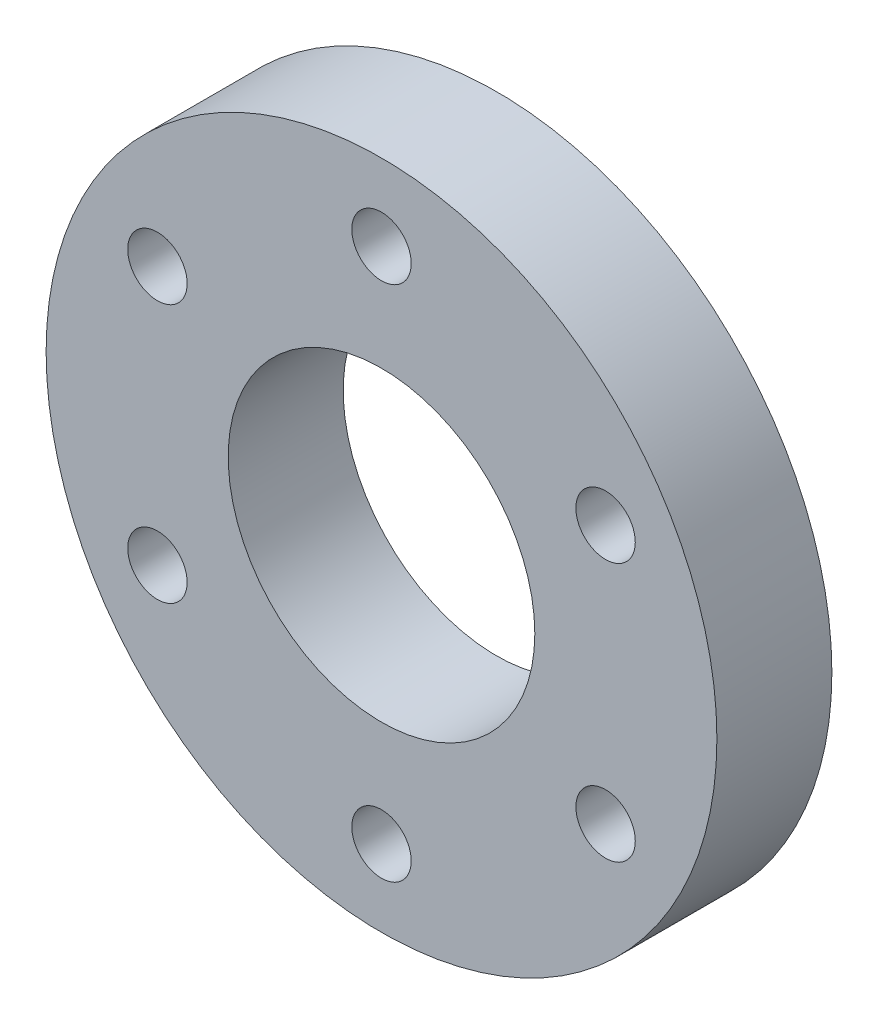
ISO-10303-21;
HEADER;
FILE_DESCRIPTION(('STEP AP214'),'2;1');
FILE_NAME('part.step','',(''),(''),'','','');
FILE_SCHEMA(('AUTOMOTIVE_DESIGN { 1 0 10303 214 1 1 1 1 }'));
ENDSEC;
DATA;
#1=APPLICATION_CONTEXT('core data for automotive mechanical design processes');
#2=APPLICATION_PROTOCOL_DEFINITION('international standard','automotive_design',2000,#1);
#3=PRODUCT_CONTEXT('',#1,'mechanical');
#4=PRODUCT('Part','Part','',(#3));
#5=PRODUCT_RELATED_PRODUCT_CATEGORY('part','',(#4));
#6=PRODUCT_DEFINITION_FORMATION('','',#4);
#7=PRODUCT_DEFINITION_CONTEXT('part definition',#1,'design');
#8=PRODUCT_DEFINITION('design','',#6,#7);
#9=PRODUCT_DEFINITION_SHAPE('','',#8);
#10=(LENGTH_UNIT() NAMED_UNIT(*) SI_UNIT(.MILLI.,.METRE.));
#11=(NAMED_UNIT(*) PLANE_ANGLE_UNIT() SI_UNIT($,.RADIAN.));
#12=(NAMED_UNIT(*) SI_UNIT($,.STERADIAN.) SOLID_ANGLE_UNIT());
#13=UNCERTAINTY_MEASURE_WITH_UNIT(LENGTH_MEASURE(1.E-05),#10,'distance_accuracy_value','');
#14=(GEOMETRIC_REPRESENTATION_CONTEXT(3) GLOBAL_UNCERTAINTY_ASSIGNED_CONTEXT((#13)) GLOBAL_UNIT_ASSIGNED_CONTEXT((#10,
#11,#12)) REPRESENTATION_CONTEXT('',''));
#15=CARTESIAN_POINT('',(0.,0.,0.));
#16=DIRECTION('',(0.,0.,1.));
#17=DIRECTION('',(1.,0.,0.));
#18=AXIS2_PLACEMENT_3D('',#15,#16,#17);
#19=CARTESIAN_POINT('',(0.,0.,6.));
#20=DIRECTION('',(0.,0.,1.));
#21=DIRECTION('',(1.,0.,0.));
#22=AXIS2_PLACEMENT_3D('',#19,#20,#21);
#23=PLANE('',#22);
#24=CARTESIAN_POINT('',(11.6913429510899,6.75000000000006,6.));
#25=DIRECTION('',(0.,0.,1.));
#26=DIRECTION('',(1.,0.,0.));
#27=AXIS2_PLACEMENT_3D('',#24,#25,#26);
#28=CIRCLE('',#27,1.55);
#29=CARTESIAN_POINT('',(13.2413429510899,6.75000000000006,6.));
#30=VERTEX_POINT('',#29);
#31=EDGE_CURVE('E92',#30,#30,#28,.T.);
#32=ORIENTED_EDGE('',*,*,#31,.F.);
#33=EDGE_LOOP('',(#32));
#34=FACE_BOUND('',#33,.T.);
#35=CARTESIAN_POINT('',(-11.6913429510899,6.74999999999997,6.));
#36=DIRECTION('',(0.,0.,1.));
#37=DIRECTION('',(1.,0.,0.));
#38=AXIS2_PLACEMENT_3D('',#35,#36,#37);
#39=CIRCLE('',#38,1.55);
#40=CARTESIAN_POINT('',(-10.1413429510899,6.74999999999997,6.));
#41=VERTEX_POINT('',#40);
#42=EDGE_CURVE('E76',#41,#41,#39,.T.);
#43=ORIENTED_EDGE('',*,*,#42,.F.);
#44=EDGE_LOOP('',(#43));
#45=FACE_BOUND('',#44,.T.);
#46=CARTESIAN_POINT('',(0.,13.5,6.));
#47=DIRECTION('',(0.,0.,1.));
#48=DIRECTION('',(1.,0.,0.));
#49=AXIS2_PLACEMENT_3D('',#46,#47,#48);
#50=CIRCLE('',#49,1.55);
#51=CARTESIAN_POINT('',(1.55,13.5,6.));
#52=VERTEX_POINT('',#51);
#53=EDGE_CURVE('E60',#52,#52,#50,.T.);
#54=ORIENTED_EDGE('',*,*,#53,.F.);
#55=EDGE_LOOP('',(#54));
#56=FACE_BOUND('',#55,.T.);
#57=CARTESIAN_POINT('',(0.,0.,6.));
#58=DIRECTION('',(0.,0.,1.));
#59=DIRECTION('',(1.,0.,0.));
#60=AXIS2_PLACEMENT_3D('',#57,#58,#59);
#61=CIRCLE('',#60,17.5);
#62=CARTESIAN_POINT('',(17.5,0.,6.));
#63=VERTEX_POINT('',#62);
#64=EDGE_CURVE('E10',#63,#63,#61,.T.);
#65=ORIENTED_EDGE('',*,*,#64,.T.);
#66=EDGE_LOOP('',(#65));
#67=FACE_BOUND('',#66,.T.);
#68=CARTESIAN_POINT('',(0.,0.,6.));
#69=DIRECTION('',(0.,0.,1.));
#70=DIRECTION('',(1.,0.,0.));
#71=AXIS2_PLACEMENT_3D('',#68,#69,#70);
#72=CIRCLE('',#71,8.);
#73=CARTESIAN_POINT('',(8.,0.,6.));
#74=VERTEX_POINT('',#73);
#75=EDGE_CURVE('E54',#74,#74,#72,.T.);
#76=ORIENTED_EDGE('',*,*,#75,.F.);
#77=EDGE_LOOP('',(#76));
#78=FACE_BOUND('',#77,.T.);
#79=CARTESIAN_POINT('',(11.6913429510899,-6.75000000000005,6.));
#80=DIRECTION('',(0.,0.,1.));
#81=DIRECTION('',(1.,0.,0.));
#82=AXIS2_PLACEMENT_3D('',#79,#80,#81);
#83=CIRCLE('',#82,1.55);
#84=CARTESIAN_POINT('',(13.2413429510899,-6.75000000000005,6.));
#85=VERTEX_POINT('',#84);
#86=EDGE_CURVE('E68',#85,#85,#83,.T.);
#87=ORIENTED_EDGE('',*,*,#86,.F.);
#88=EDGE_LOOP('',(#87));
#89=FACE_BOUND('',#88,.T.);
#90=CARTESIAN_POINT('',(-11.6913429510899,-6.74999999999997,6.));
#91=DIRECTION('',(0.,0.,1.));
#92=DIRECTION('',(1.,0.,0.));
#93=AXIS2_PLACEMENT_3D('',#90,#91,#92);
#94=CIRCLE('',#93,1.55);
#95=CARTESIAN_POINT('',(-10.1413429510899,-6.74999999999997,6.));
#96=VERTEX_POINT('',#95);
#97=EDGE_CURVE('E84',#96,#96,#94,.T.);
#98=ORIENTED_EDGE('',*,*,#97,.F.);
#99=EDGE_LOOP('',(#98));
#100=FACE_BOUND('',#99,.T.);
#101=CARTESIAN_POINT('',(0.,-13.5,6.));
#102=DIRECTION('',(0.,0.,1.));
#103=DIRECTION('',(1.,0.,0.));
#104=AXIS2_PLACEMENT_3D('',#101,#102,#103);
#105=CIRCLE('',#104,1.55);
#106=CARTESIAN_POINT('',(1.55,-13.5,6.));
#107=VERTEX_POINT('',#106);
#108=EDGE_CURVE('E100',#107,#107,#105,.T.);
#109=ORIENTED_EDGE('',*,*,#108,.F.);
#110=EDGE_LOOP('',(#109));
#111=FACE_BOUND('',#110,.T.);
#112=ADVANCED_FACE('F41',(#34,#45,#56,#67,#78,#89,#100,#111),#23,.T.);
#113=CARTESIAN_POINT('',(0.,0.,0.));
#114=DIRECTION('',(0.,0.,1.));
#115=DIRECTION('',(1.,0.,0.));
#116=AXIS2_PLACEMENT_3D('',#113,#114,#115);
#117=PLANE('',#116);
#118=CARTESIAN_POINT('',(0.,0.,0.));
#119=DIRECTION('',(0.,0.,1.));
#120=DIRECTION('',(1.,0.,0.));
#121=AXIS2_PLACEMENT_3D('',#118,#119,#120);
#122=CIRCLE('',#121,17.5);
#123=CARTESIAN_POINT('',(17.5,0.,0.));
#124=VERTEX_POINT('',#123);
#125=EDGE_CURVE('E45',#124,#124,#122,.T.);
#126=ORIENTED_EDGE('',*,*,#125,.F.);
#127=EDGE_LOOP('',(#126));
#128=FACE_BOUND('',#127,.T.);
#129=CARTESIAN_POINT('',(0.,0.,0.));
#130=DIRECTION('',(0.,0.,1.));
#131=DIRECTION('',(1.,0.,0.));
#132=AXIS2_PLACEMENT_3D('',#129,#130,#131);
#133=CIRCLE('',#132,8.);
#134=CARTESIAN_POINT('',(8.,0.,0.));
#135=VERTEX_POINT('',#134);
#136=EDGE_CURVE('E56',#135,#135,#133,.T.);
#137=ORIENTED_EDGE('',*,*,#136,.T.);
#138=EDGE_LOOP('',(#137));
#139=FACE_BOUND('',#138,.T.);
#140=CARTESIAN_POINT('',(0.,13.5,0.));
#141=DIRECTION('',(0.,0.,1.));
#142=DIRECTION('',(1.,0.,0.));
#143=AXIS2_PLACEMENT_3D('',#140,#141,#142);
#144=CIRCLE('',#143,1.55);
#145=CARTESIAN_POINT('',(1.55,13.5,0.));
#146=VERTEX_POINT('',#145);
#147=EDGE_CURVE('E64',#146,#146,#144,.T.);
#148=ORIENTED_EDGE('',*,*,#147,.T.);
#149=EDGE_LOOP('',(#148));
#150=FACE_BOUND('',#149,.T.);
#151=CARTESIAN_POINT('',(11.6913429510899,-6.75000000000005,0.));
#152=DIRECTION('',(0.,0.,1.));
#153=DIRECTION('',(1.,0.,0.));
#154=AXIS2_PLACEMENT_3D('',#151,#152,#153);
#155=CIRCLE('',#154,1.55);
#156=CARTESIAN_POINT('',(13.2413429510899,-6.75000000000005,0.));
#157=VERTEX_POINT('',#156);
#158=EDGE_CURVE('E72',#157,#157,#155,.T.);
#159=ORIENTED_EDGE('',*,*,#158,.T.);
#160=EDGE_LOOP('',(#159));
#161=FACE_BOUND('',#160,.T.);
#162=CARTESIAN_POINT('',(-11.6913429510899,6.74999999999997,0.));
#163=DIRECTION('',(0.,0.,1.));
#164=DIRECTION('',(1.,0.,0.));
#165=AXIS2_PLACEMENT_3D('',#162,#163,#164);
#166=CIRCLE('',#165,1.55);
#167=CARTESIAN_POINT('',(-10.1413429510899,6.74999999999997,0.));
#168=VERTEX_POINT('',#167);
#169=EDGE_CURVE('E80',#168,#168,#166,.T.);
#170=ORIENTED_EDGE('',*,*,#169,.T.);
#171=EDGE_LOOP('',(#170));
#172=FACE_BOUND('',#171,.T.);
#173=CARTESIAN_POINT('',(-11.6913429510899,-6.74999999999997,0.));
#174=DIRECTION('',(0.,0.,1.));
#175=DIRECTION('',(1.,0.,0.));
#176=AXIS2_PLACEMENT_3D('',#173,#174,#175);
#177=CIRCLE('',#176,1.55);
#178=CARTESIAN_POINT('',(-10.1413429510899,-6.74999999999997,0.));
#179=VERTEX_POINT('',#178);
#180=EDGE_CURVE('E88',#179,#179,#177,.T.);
#181=ORIENTED_EDGE('',*,*,#180,.T.);
#182=EDGE_LOOP('',(#181));
#183=FACE_BOUND('',#182,.T.);
#184=CARTESIAN_POINT('',(11.6913429510899,6.75000000000006,0.));
#185=DIRECTION('',(0.,0.,1.));
#186=DIRECTION('',(1.,0.,0.));
#187=AXIS2_PLACEMENT_3D('',#184,#185,#186);
#188=CIRCLE('',#187,1.55);
#189=CARTESIAN_POINT('',(13.2413429510899,6.75000000000006,0.));
#190=VERTEX_POINT('',#189);
#191=EDGE_CURVE('E96',#190,#190,#188,.T.);
#192=ORIENTED_EDGE('',*,*,#191,.T.);
#193=EDGE_LOOP('',(#192));
#194=FACE_BOUND('',#193,.T.);
#195=CARTESIAN_POINT('',(0.,-13.5,0.));
#196=DIRECTION('',(0.,0.,1.));
#197=DIRECTION('',(1.,0.,0.));
#198=AXIS2_PLACEMENT_3D('',#195,#196,#197);
#199=CIRCLE('',#198,1.55);
#200=CARTESIAN_POINT('',(1.55,-13.5,0.));
#201=VERTEX_POINT('',#200);
#202=EDGE_CURVE('E104',#201,#201,#199,.T.);
#203=ORIENTED_EDGE('',*,*,#202,.T.);
#204=EDGE_LOOP('',(#203));
#205=FACE_BOUND('',#204,.T.);
#206=ADVANCED_FACE('F116',(#128,#139,#150,#161,#172,#183,#194,#205),#117,.F.);
#207=CARTESIAN_POINT('',(0.,0.,6.));
#208=DIRECTION('',(0.,0.,-1.));
#209=DIRECTION('',(-1.,0.,0.));
#210=AXIS2_PLACEMENT_3D('',#207,#208,#209);
#211=CYLINDRICAL_SURFACE('',#210,17.5);
#212=ORIENTED_EDGE('',*,*,#64,.F.);
#213=EDGE_LOOP('',(#212));
#214=FACE_BOUND('',#213,.T.);
#215=ORIENTED_EDGE('',*,*,#125,.T.);
#216=EDGE_LOOP('',(#215));
#217=FACE_BOUND('',#216,.T.);
#218=ADVANCED_FACE('F43',(#214,#217),#211,.T.);
#219=CARTESIAN_POINT('',(0.,0.,6.));
#220=DIRECTION('',(0.,0.,-1.));
#221=DIRECTION('',(-1.,0.,0.));
#222=AXIS2_PLACEMENT_3D('',#219,#220,#221);
#223=CYLINDRICAL_SURFACE('',#222,8.);
#224=ORIENTED_EDGE('',*,*,#75,.T.);
#225=EDGE_LOOP('',(#224));
#226=FACE_BOUND('',#225,.T.);
#227=ORIENTED_EDGE('',*,*,#136,.F.);
#228=EDGE_LOOP('',(#227));
#229=FACE_BOUND('',#228,.T.);
#230=ADVANCED_FACE('F126',(#226,#229),#223,.F.);
#231=CARTESIAN_POINT('',(0.,13.5,6.));
#232=DIRECTION('',(0.,0.,-1.));
#233=DIRECTION('',(-1.,0.,0.));
#234=AXIS2_PLACEMENT_3D('',#231,#232,#233);
#235=CYLINDRICAL_SURFACE('',#234,1.55);
#236=ORIENTED_EDGE('',*,*,#53,.T.);
#237=EDGE_LOOP('',(#236));
#238=FACE_BOUND('',#237,.T.);
#239=ORIENTED_EDGE('',*,*,#147,.F.);
#240=EDGE_LOOP('',(#239));
#241=FACE_BOUND('',#240,.T.);
#242=ADVANCED_FACE('F129',(#238,#241),#235,.F.);
#243=CARTESIAN_POINT('',(11.6913429510899,-6.75000000000005,6.));
#244=DIRECTION('',(0.,0.,-1.));
#245=DIRECTION('',(-1.,0.,0.));
#246=AXIS2_PLACEMENT_3D('',#243,#244,#245);
#247=CYLINDRICAL_SURFACE('',#246,1.55);
#248=ORIENTED_EDGE('',*,*,#86,.T.);
#249=EDGE_LOOP('',(#248));
#250=FACE_BOUND('',#249,.T.);
#251=ORIENTED_EDGE('',*,*,#158,.F.);
#252=EDGE_LOOP('',(#251));
#253=FACE_BOUND('',#252,.T.);
#254=ADVANCED_FACE('F133',(#250,#253),#247,.F.);
#255=CARTESIAN_POINT('',(-11.6913429510899,6.74999999999997,6.));
#256=DIRECTION('',(0.,0.,-1.));
#257=DIRECTION('',(-1.,0.,0.));
#258=AXIS2_PLACEMENT_3D('',#255,#256,#257);
#259=CYLINDRICAL_SURFACE('',#258,1.55);
#260=ORIENTED_EDGE('',*,*,#42,.T.);
#261=EDGE_LOOP('',(#260));
#262=FACE_BOUND('',#261,.T.);
#263=ORIENTED_EDGE('',*,*,#169,.F.);
#264=EDGE_LOOP('',(#263));
#265=FACE_BOUND('',#264,.T.);
#266=ADVANCED_FACE('F137',(#262,#265),#259,.F.);
#267=CARTESIAN_POINT('',(-11.6913429510899,-6.74999999999997,6.));
#268=DIRECTION('',(0.,0.,-1.));
#269=DIRECTION('',(-1.,0.,0.));
#270=AXIS2_PLACEMENT_3D('',#267,#268,#269);
#271=CYLINDRICAL_SURFACE('',#270,1.55);
#272=ORIENTED_EDGE('',*,*,#97,.T.);
#273=EDGE_LOOP('',(#272));
#274=FACE_BOUND('',#273,.T.);
#275=ORIENTED_EDGE('',*,*,#180,.F.);
#276=EDGE_LOOP('',(#275));
#277=FACE_BOUND('',#276,.T.);
#278=ADVANCED_FACE('F141',(#274,#277),#271,.F.);
#279=CARTESIAN_POINT('',(11.6913429510899,6.75000000000006,6.));
#280=DIRECTION('',(0.,0.,-1.));
#281=DIRECTION('',(-1.,0.,0.));
#282=AXIS2_PLACEMENT_3D('',#279,#280,#281);
#283=CYLINDRICAL_SURFACE('',#282,1.55);
#284=ORIENTED_EDGE('',*,*,#31,.T.);
#285=EDGE_LOOP('',(#284));
#286=FACE_BOUND('',#285,.T.);
#287=ORIENTED_EDGE('',*,*,#191,.F.);
#288=EDGE_LOOP('',(#287));
#289=FACE_BOUND('',#288,.T.);
#290=ADVANCED_FACE('F145',(#286,#289),#283,.F.);
#291=CARTESIAN_POINT('',(0.,-13.5,6.));
#292=DIRECTION('',(0.,0.,-1.));
#293=DIRECTION('',(-1.,0.,0.));
#294=AXIS2_PLACEMENT_3D('',#291,#292,#293);
#295=CYLINDRICAL_SURFACE('',#294,1.55);
#296=ORIENTED_EDGE('',*,*,#108,.T.);
#297=EDGE_LOOP('',(#296));
#298=FACE_BOUND('',#297,.T.);
#299=ORIENTED_EDGE('',*,*,#202,.F.);
#300=EDGE_LOOP('',(#299));
#301=FACE_BOUND('',#300,.T.);
#302=ADVANCED_FACE('F112',(#298,#301),#295,.F.);
#303=CLOSED_SHELL('',(#112,#206,#218,#230,#242,#254,#266,#278,#290,#302));
#304=MANIFOLD_SOLID_BREP('B2',#303);
#305=ADVANCED_BREP_SHAPE_REPRESENTATION('',(#18,#304),#14);
#306=SHAPE_DEFINITION_REPRESENTATION(#9,#305);
ENDSEC;
END-ISO-10303-21;
